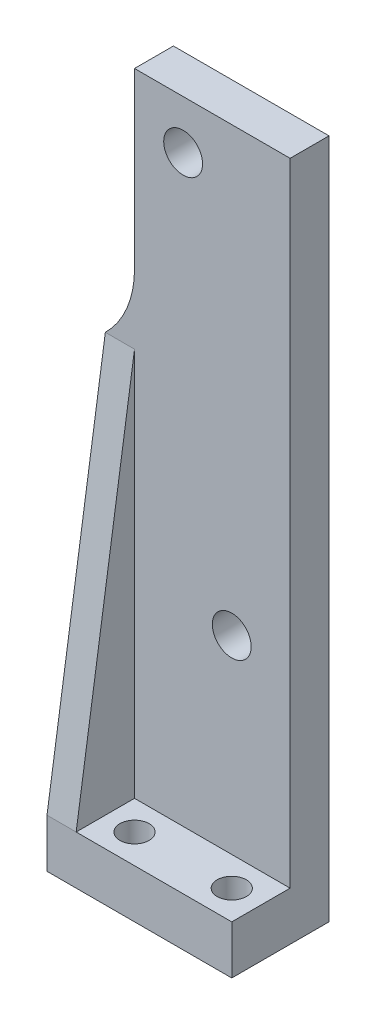
ISO-10303-21;
HEADER;
FILE_DESCRIPTION(('STEP AP214'),'2;1');
FILE_NAME('part.step','',(''),(''),'','','');
FILE_SCHEMA(('AUTOMOTIVE_DESIGN { 1 0 10303 214 1 1 1 1 }'));
ENDSEC;
DATA;
#1=APPLICATION_CONTEXT('core data for automotive mechanical design processes');
#2=APPLICATION_PROTOCOL_DEFINITION('international standard','automotive_design',2000,#1);
#3=PRODUCT_CONTEXT('',#1,'mechanical');
#4=PRODUCT('Part','Part','',(#3));
#5=PRODUCT_RELATED_PRODUCT_CATEGORY('part','',(#4));
#6=PRODUCT_DEFINITION_FORMATION('','',#4);
#7=PRODUCT_DEFINITION_CONTEXT('part definition',#1,'design');
#8=PRODUCT_DEFINITION('design','',#6,#7);
#9=PRODUCT_DEFINITION_SHAPE('','',#8);
#10=(LENGTH_UNIT() NAMED_UNIT(*) SI_UNIT(.MILLI.,.METRE.));
#11=(NAMED_UNIT(*) PLANE_ANGLE_UNIT() SI_UNIT($,.RADIAN.));
#12=(NAMED_UNIT(*) SI_UNIT($,.STERADIAN.) SOLID_ANGLE_UNIT());
#13=UNCERTAINTY_MEASURE_WITH_UNIT(LENGTH_MEASURE(1.E-05),#10,'distance_accuracy_value','');
#14=(GEOMETRIC_REPRESENTATION_CONTEXT(3) GLOBAL_UNCERTAINTY_ASSIGNED_CONTEXT((#13)) GLOBAL_UNIT_ASSIGNED_CONTEXT((#10,
#11,#12)) REPRESENTATION_CONTEXT('',''));
#15=CARTESIAN_POINT('',(0.,0.,0.));
#16=DIRECTION('',(0.,0.,1.));
#17=DIRECTION('',(1.,0.,0.));
#18=AXIS2_PLACEMENT_3D('',#15,#16,#17);
#19=CARTESIAN_POINT('',(-10.,5.,0.));
#20=DIRECTION('',(1.,0.,0.));
#21=DIRECTION('',(0.,0.,-1.));
#22=AXIS2_PLACEMENT_3D('',#19,#20,#21);
#23=PLANE('',#22);
#24=DIRECTION('',(0.,-1.,0.));
#25=VECTOR('',#24,1.);
#26=CARTESIAN_POINT('',(-9.99999999999999,70.,-7.));
#27=LINE('',#26,#25);
#28=CARTESIAN_POINT('',(-9.99999999999999,70.,-7.));
#29=VERTEX_POINT('',#28);
#30=CARTESIAN_POINT('',(-9.99999999999999,52.1414284285429,-7.));
#31=VERTEX_POINT('',#30);
#32=EDGE_CURVE('E162',#29,#31,#27,.T.);
#33=ORIENTED_EDGE('',*,*,#32,.T.);
#34=DIRECTION('',(0.,0.,-1.));
#35=VECTOR('',#34,1.);
#36=CARTESIAN_POINT('',(-10.,52.1414284285429,0.));
#37=LINE('',#36,#35);
#38=CARTESIAN_POINT('',(-9.99999999999999,52.1414284285429,-3.));
#39=VERTEX_POINT('',#38);
#40=EDGE_CURVE('E206',#31,#39,#37,.F.);
#41=ORIENTED_EDGE('',*,*,#40,.T.);
#42=DIRECTION('',(0.,-1.,0.));
#43=VECTOR('',#42,1.);
#44=CARTESIAN_POINT('',(-9.99999999999999,70.,-3.));
#45=LINE('',#44,#43);
#46=CARTESIAN_POINT('',(-9.99999999999999,70.,-3.));
#47=VERTEX_POINT('',#46);
#48=EDGE_CURVE('E156',#47,#39,#45,.T.);
#49=ORIENTED_EDGE('',*,*,#48,.F.);
#50=DIRECTION('',(0.,0.,1.));
#51=VECTOR('',#50,1.);
#52=CARTESIAN_POINT('',(-9.99999999999999,70.,-7.));
#53=LINE('',#52,#51);
#54=EDGE_CURVE('E174',#29,#47,#53,.T.);
#55=ORIENTED_EDGE('',*,*,#54,.F.);
#56=EDGE_LOOP('',(#33,#41,#49,#55));
#57=FACE_BOUND('',#56,.T.);
#58=ADVANCED_FACE('F41',(#57),#23,.F.);
#59=CARTESIAN_POINT('',(-5.,65.,3.));
#60=DIRECTION('',(0.,0.,-1.));
#61=DIRECTION('',(-1.,0.,0.));
#62=AXIS2_PLACEMENT_3D('',#59,#60,#61);
#63=CYLINDRICAL_SURFACE('',#62,2.);
#64=CARTESIAN_POINT('',(-5.,65.,-3.));
#65=DIRECTION('',(0.,0.,1.));
#66=DIRECTION('',(1.,0.,0.));
#67=AXIS2_PLACEMENT_3D('',#64,#65,#66);
#68=CIRCLE('',#67,2.);
#69=CARTESIAN_POINT('',(-3.,65.,-3.));
#70=VERTEX_POINT('',#69);
#71=EDGE_CURVE('E168',#70,#70,#68,.T.);
#72=ORIENTED_EDGE('',*,*,#71,.T.);
#73=EDGE_LOOP('',(#72));
#74=FACE_BOUND('',#73,.T.);
#75=CARTESIAN_POINT('',(-5.,65.,-6.));
#76=DIRECTION('',(0.,0.,-1.));
#77=DIRECTION('',(-1.,0.,0.));
#78=AXIS2_PLACEMENT_3D('',#75,#76,#77);
#79=CIRCLE('',#78,2.);
#80=CARTESIAN_POINT('',(-7.,65.,-6.));
#81=VERTEX_POINT('',#80);
#82=EDGE_CURVE('E146',#81,#81,#79,.F.);
#83=ORIENTED_EDGE('',*,*,#82,.F.);
#84=EDGE_LOOP('',(#83));
#85=FACE_BOUND('',#84,.T.);
#86=ADVANCED_FACE('F243',(#74,#85),#63,.F.);
#87=CARTESIAN_POINT('',(0.,5.,3.));
#88=DIRECTION('',(0.,0.,-1.));
#89=DIRECTION('',(-1.,0.,0.));
#90=AXIS2_PLACEMENT_3D('',#87,#88,#89);
#91=PLANE('',#90);
#92=DIRECTION('',(1.,0.,0.));
#93=VECTOR('',#92,1.);
#94=CARTESIAN_POINT('',(0.,0.,3.));
#95=LINE('',#94,#93);
#96=CARTESIAN_POINT('',(-13.,0.,3.));
#97=VERTEX_POINT('',#96);
#98=CARTESIAN_POINT('',(6.,0.,3.));
#99=VERTEX_POINT('',#98);
#100=EDGE_CURVE('E201',#97,#99,#95,.T.);
#101=ORIENTED_EDGE('',*,*,#100,.T.);
#102=DIRECTION('',(0.,-1.,0.));
#103=VECTOR('',#102,1.);
#104=CARTESIAN_POINT('',(6.,5.,3.));
#105=LINE('',#104,#103);
#106=CARTESIAN_POINT('',(6.,5.,3.));
#107=VERTEX_POINT('',#106);
#108=EDGE_CURVE('E195',#107,#99,#105,.T.);
#109=ORIENTED_EDGE('',*,*,#108,.F.);
#110=DIRECTION('',(1.,0.,0.));
#111=VECTOR('',#110,1.);
#112=CARTESIAN_POINT('',(0.,5.,3.));
#113=LINE('',#112,#111);
#114=CARTESIAN_POINT('',(-10.,5.,3.));
#115=VERTEX_POINT('',#114);
#116=EDGE_CURVE('E134',#115,#107,#113,.T.);
#117=ORIENTED_EDGE('',*,*,#116,.F.);
#118=DIRECTION('',(1.,0.,0.));
#119=VECTOR('',#118,1.);
#120=CARTESIAN_POINT('',(-13.,5.,3.));
#121=LINE('',#120,#119);
#122=CARTESIAN_POINT('',(-13.,5.,3.));
#123=VERTEX_POINT('',#122);
#124=EDGE_CURVE('E116',#123,#115,#121,.T.);
#125=ORIENTED_EDGE('',*,*,#124,.F.);
#126=DIRECTION('',(0.,1.,0.));
#127=VECTOR('',#126,1.);
#128=CARTESIAN_POINT('',(-13.,0.,3.));
#129=LINE('',#128,#127);
#130=EDGE_CURVE('E119',#97,#123,#129,.T.);
#131=ORIENTED_EDGE('',*,*,#130,.F.);
#132=EDGE_LOOP('',(#101,#109,#117,#125,#131));
#133=FACE_BOUND('',#132,.T.);
#134=ADVANCED_FACE('F132',(#133),#91,.F.);
#135=CARTESIAN_POINT('',(6.,5.,0.));
#136=DIRECTION('',(1.,0.,0.));
#137=DIRECTION('',(0.,0.,-1.));
#138=AXIS2_PLACEMENT_3D('',#135,#136,#137);
#139=PLANE('',#138);
#140=DIRECTION('',(0.,0.,1.));
#141=VECTOR('',#140,1.);
#142=CARTESIAN_POINT('',(6.,0.,0.));
#143=LINE('',#142,#141);
#144=CARTESIAN_POINT('',(6.,0.,-7.));
#145=VERTEX_POINT('',#144);
#146=EDGE_CURVE('E183',#145,#99,#143,.T.);
#147=ORIENTED_EDGE('',*,*,#146,.F.);
#148=DIRECTION('',(0.,1.,0.));
#149=VECTOR('',#148,1.);
#150=CARTESIAN_POINT('',(6.,0.,-7.));
#151=LINE('',#150,#149);
#152=CARTESIAN_POINT('',(6.,70.,-7.));
#153=VERTEX_POINT('',#152);
#154=EDGE_CURVE('E155',#145,#153,#151,.T.);
#155=ORIENTED_EDGE('',*,*,#154,.T.);
#156=DIRECTION('',(0.,0.,1.));
#157=VECTOR('',#156,1.);
#158=CARTESIAN_POINT('',(6.,70.,-7.));
#159=LINE('',#158,#157);
#160=CARTESIAN_POINT('',(6.,70.,-3.));
#161=VERTEX_POINT('',#160);
#162=EDGE_CURVE('E164',#153,#161,#159,.T.);
#163=ORIENTED_EDGE('',*,*,#162,.T.);
#164=DIRECTION('',(0.,1.,0.));
#165=VECTOR('',#164,1.);
#166=CARTESIAN_POINT('',(6.,0.,-3.));
#167=LINE('',#166,#165);
#168=CARTESIAN_POINT('',(6.,5.,-3.));
#169=VERTEX_POINT('',#168);
#170=EDGE_CURVE('E165',#169,#161,#167,.T.);
#171=ORIENTED_EDGE('',*,*,#170,.F.);
#172=DIRECTION('',(0.,0.,1.));
#173=VECTOR('',#172,1.);
#174=CARTESIAN_POINT('',(6.,5.,0.));
#175=LINE('',#174,#173);
#176=EDGE_CURVE('E187',#169,#107,#175,.T.);
#177=ORIENTED_EDGE('',*,*,#176,.T.);
#178=ORIENTED_EDGE('',*,*,#108,.T.);
#179=EDGE_LOOP('',(#147,#155,#163,#171,#177,#178));
#180=FACE_BOUND('',#179,.T.);
#181=ADVANCED_FACE('F227',(#180),#139,.T.);
#182=CARTESIAN_POINT('',(-7.,5.,0.));
#183=DIRECTION('',(0.,-1.,0.));
#184=DIRECTION('',(0.,0.,-1.));
#185=AXIS2_PLACEMENT_3D('',#182,#183,#184);
#186=CYLINDRICAL_SURFACE('',#185,1.5);
#187=CARTESIAN_POINT('',(-7.,5.,0.));
#188=DIRECTION('',(0.,1.,0.));
#189=DIRECTION('',(0.,0.,1.));
#190=AXIS2_PLACEMENT_3D('',#187,#188,#189);
#191=CIRCLE('',#190,1.5);
#192=CARTESIAN_POINT('',(-7.,5.,1.5));
#193=VERTEX_POINT('',#192);
#194=EDGE_CURVE('E182',#193,#193,#191,.T.);
#195=ORIENTED_EDGE('',*,*,#194,.T.);
#196=EDGE_LOOP('',(#195));
#197=FACE_BOUND('',#196,.T.);
#198=CARTESIAN_POINT('',(-7.,0.,0.));
#199=DIRECTION('',(0.,1.,0.));
#200=DIRECTION('',(0.,0.,1.));
#201=AXIS2_PLACEMENT_3D('',#198,#199,#200);
#202=CIRCLE('',#201,1.5);
#203=CARTESIAN_POINT('',(-7.,0.,1.5));
#204=VERTEX_POINT('',#203);
#205=EDGE_CURVE('E198',#204,#204,#202,.T.);
#206=ORIENTED_EDGE('',*,*,#205,.F.);
#207=EDGE_LOOP('',(#206));
#208=FACE_BOUND('',#207,.T.);
#209=ADVANCED_FACE('F256',(#197,#208),#186,.F.);
#210=CARTESIAN_POINT('',(3.,5.,0.));
#211=DIRECTION('',(0.,-1.,0.));
#212=DIRECTION('',(0.,0.,-1.));
#213=AXIS2_PLACEMENT_3D('',#210,#211,#212);
#214=CYLINDRICAL_SURFACE('',#213,1.5);
#215=CARTESIAN_POINT('',(3.,5.,0.));
#216=DIRECTION('',(0.,1.,0.));
#217=DIRECTION('',(0.,0.,1.));
#218=AXIS2_PLACEMENT_3D('',#215,#216,#217);
#219=CIRCLE('',#218,1.5);
#220=CARTESIAN_POINT('',(3.,5.,1.5));
#221=VERTEX_POINT('',#220);
#222=EDGE_CURVE('E179',#221,#221,#219,.T.);
#223=ORIENTED_EDGE('',*,*,#222,.T.);
#224=EDGE_LOOP('',(#223));
#225=FACE_BOUND('',#224,.T.);
#226=CARTESIAN_POINT('',(3.,0.,0.));
#227=DIRECTION('',(0.,1.,0.));
#228=DIRECTION('',(0.,0.,1.));
#229=AXIS2_PLACEMENT_3D('',#226,#227,#228);
#230=CIRCLE('',#229,1.5);
#231=CARTESIAN_POINT('',(3.,0.,1.5));
#232=VERTEX_POINT('',#231);
#233=EDGE_CURVE('E176',#232,#232,#230,.T.);
#234=ORIENTED_EDGE('',*,*,#233,.F.);
#235=EDGE_LOOP('',(#234));
#236=FACE_BOUND('',#235,.T.);
#237=ADVANCED_FACE('F260',(#225,#236),#214,.F.);
#238=CARTESIAN_POINT('',(0.,5.,0.));
#239=DIRECTION('',(0.,1.,0.));
#240=DIRECTION('',(0.,0.,1.));
#241=AXIS2_PLACEMENT_3D('',#238,#239,#240);
#242=PLANE('',#241);
#243=ORIENTED_EDGE('',*,*,#222,.F.);
#244=EDGE_LOOP('',(#243));
#245=FACE_BOUND('',#244,.T.);
#246=ORIENTED_EDGE('',*,*,#194,.F.);
#247=EDGE_LOOP('',(#246));
#248=FACE_BOUND('',#247,.T.);
#249=ORIENTED_EDGE('',*,*,#116,.T.);
#250=ORIENTED_EDGE('',*,*,#176,.F.);
#251=DIRECTION('',(1.,0.,0.));
#252=VECTOR('',#251,1.);
#253=CARTESIAN_POINT('',(0.,5.,-3.));
#254=LINE('',#253,#252);
#255=CARTESIAN_POINT('',(-10.,5.,-3.));
#256=VERTEX_POINT('',#255);
#257=EDGE_CURVE('E190',#256,#169,#254,.T.);
#258=ORIENTED_EDGE('',*,*,#257,.F.);
#259=DIRECTION('',(0.,0.,1.));
#260=VECTOR('',#259,1.);
#261=CARTESIAN_POINT('',(-10.,5.,0.));
#262=LINE('',#261,#260);
#263=EDGE_CURVE('E193',#256,#115,#262,.T.);
#264=ORIENTED_EDGE('',*,*,#263,.T.);
#265=EDGE_LOOP('',(#249,#250,#258,#264));
#266=FACE_BOUND('',#265,.T.);
#267=ADVANCED_FACE('F230',(#245,#248,#266),#242,.T.);
#268=CARTESIAN_POINT('',(0.,0.,0.));
#269=DIRECTION('',(0.,1.,0.));
#270=DIRECTION('',(0.,0.,1.));
#271=AXIS2_PLACEMENT_3D('',#268,#269,#270);
#272=PLANE('',#271);
#273=ORIENTED_EDGE('',*,*,#233,.T.);
#274=EDGE_LOOP('',(#273));
#275=FACE_BOUND('',#274,.T.);
#276=ORIENTED_EDGE('',*,*,#205,.T.);
#277=EDGE_LOOP('',(#276));
#278=FACE_BOUND('',#277,.T.);
#279=ORIENTED_EDGE('',*,*,#100,.F.);
#280=DIRECTION('',(0.,0.,1.));
#281=VECTOR('',#280,1.);
#282=CARTESIAN_POINT('',(-13.,0.,0.));
#283=LINE('',#282,#281);
#284=CARTESIAN_POINT('',(-13.,0.,-7.));
#285=VERTEX_POINT('',#284);
#286=EDGE_CURVE('E126',#285,#97,#283,.T.);
#287=ORIENTED_EDGE('',*,*,#286,.F.);
#288=DIRECTION('',(1.,0.,0.));
#289=VECTOR('',#288,1.);
#290=CARTESIAN_POINT('',(-10.,0.,-7.));
#291=LINE('',#290,#289);
#292=EDGE_CURVE('E152',#285,#145,#291,.T.);
#293=ORIENTED_EDGE('',*,*,#292,.T.);
#294=ORIENTED_EDGE('',*,*,#146,.T.);
#295=EDGE_LOOP('',(#279,#287,#293,#294));
#296=FACE_BOUND('',#295,.T.);
#297=ADVANCED_FACE('F224',(#275,#278,#296),#272,.F.);
#298=CARTESIAN_POINT('',(6.,70.,-7.));
#299=DIRECTION('',(0.,1.,0.));
#300=DIRECTION('',(0.,0.,1.));
#301=AXIS2_PLACEMENT_3D('',#298,#299,#300);
#302=PLANE('',#301);
#303=DIRECTION('',(-1.,0.,0.));
#304=VECTOR('',#303,1.);
#305=CARTESIAN_POINT('',(6.,70.,-3.));
#306=LINE('',#305,#304);
#307=EDGE_CURVE('E167',#161,#47,#306,.T.);
#308=ORIENTED_EDGE('',*,*,#307,.F.);
#309=ORIENTED_EDGE('',*,*,#162,.F.);
#310=DIRECTION('',(-1.,0.,0.));
#311=VECTOR('',#310,1.);
#312=CARTESIAN_POINT('',(6.,70.,-7.));
#313=LINE('',#312,#311);
#314=EDGE_CURVE('E159',#153,#29,#313,.T.);
#315=ORIENTED_EDGE('',*,*,#314,.T.);
#316=ORIENTED_EDGE('',*,*,#54,.T.);
#317=EDGE_LOOP('',(#308,#309,#315,#316));
#318=FACE_BOUND('',#317,.T.);
#319=ADVANCED_FACE('F274',(#318),#302,.T.);
#320=CARTESIAN_POINT('',(0.,0.,-7.));
#321=DIRECTION('',(0.,0.,1.));
#322=DIRECTION('',(1.,0.,0.));
#323=AXIS2_PLACEMENT_3D('',#320,#321,#322);
#324=PLANE('',#323);
#325=CARTESIAN_POINT('',(-5.,65.,-7.));
#326=DIRECTION('',(0.,0.,-1.));
#327=DIRECTION('',(-1.,0.,0.));
#328=AXIS2_PLACEMENT_3D('',#325,#326,#327);
#329=CIRCLE('',#328,3.5);
#330=CARTESIAN_POINT('',(-8.5,65.,-7.));
#331=VERTEX_POINT('',#330);
#332=EDGE_CURVE('E136',#331,#331,#329,.T.);
#333=ORIENTED_EDGE('',*,*,#332,.F.);
#334=EDGE_LOOP('',(#333));
#335=FACE_BOUND('',#334,.T.);
#336=CARTESIAN_POINT('',(0.,24.5,-7.));
#337=DIRECTION('',(0.,0.,-1.));
#338=DIRECTION('',(-1.,0.,0.));
#339=AXIS2_PLACEMENT_3D('',#336,#337,#338);
#340=CIRCLE('',#339,2.);
#341=CARTESIAN_POINT('',(-2.,24.5,-7.));
#342=VERTEX_POINT('',#341);
#343=EDGE_CURVE('E148',#342,#342,#340,.T.);
#344=ORIENTED_EDGE('',*,*,#343,.F.);
#345=EDGE_LOOP('',(#344));
#346=FACE_BOUND('',#345,.T.);
#347=ORIENTED_EDGE('',*,*,#292,.F.);
#348=DIRECTION('',(0.,-1.,0.));
#349=VECTOR('',#348,1.);
#350=CARTESIAN_POINT('',(-13.,0.,-7.));
#351=LINE('',#350,#349);
#352=CARTESIAN_POINT('',(-13.,45.,-7.));
#353=VERTEX_POINT('',#352);
#354=EDGE_CURVE('E141',#353,#285,#351,.T.);
#355=ORIENTED_EDGE('',*,*,#354,.F.);
#356=CARTESIAN_POINT('',(-20.,52.1414284285429,-7.));
#357=DIRECTION('',(0.,0.,1.));
#358=DIRECTION('',(1.,0.,0.));
#359=AXIS2_PLACEMENT_3D('',#356,#357,#358);
#360=CIRCLE('',#359,10.);
#361=EDGE_CURVE('E64',#353,#31,#360,.T.);
#362=ORIENTED_EDGE('',*,*,#361,.T.);
#363=ORIENTED_EDGE('',*,*,#32,.F.);
#364=ORIENTED_EDGE('',*,*,#314,.F.);
#365=ORIENTED_EDGE('',*,*,#154,.F.);
#366=EDGE_LOOP('',(#347,#355,#362,#363,#364,#365));
#367=FACE_BOUND('',#366,.T.);
#368=ADVANCED_FACE('F280',(#335,#346,#367),#324,.F.);
#369=CARTESIAN_POINT('',(0.,0.,-3.));
#370=DIRECTION('',(0.,0.,1.));
#371=DIRECTION('',(1.,0.,0.));
#372=AXIS2_PLACEMENT_3D('',#369,#370,#371);
#373=PLANE('',#372);
#374=CARTESIAN_POINT('',(0.,24.5,-3.));
#375=DIRECTION('',(0.,0.,1.));
#376=DIRECTION('',(1.,0.,0.));
#377=AXIS2_PLACEMENT_3D('',#374,#375,#376);
#378=CIRCLE('',#377,2.);
#379=CARTESIAN_POINT('',(2.,24.5,-3.));
#380=VERTEX_POINT('',#379);
#381=EDGE_CURVE('E151',#380,#380,#378,.T.);
#382=ORIENTED_EDGE('',*,*,#381,.F.);
#383=EDGE_LOOP('',(#382));
#384=FACE_BOUND('',#383,.T.);
#385=ORIENTED_EDGE('',*,*,#71,.F.);
#386=EDGE_LOOP('',(#385));
#387=FACE_BOUND('',#386,.T.);
#388=ORIENTED_EDGE('',*,*,#48,.T.);
#389=CARTESIAN_POINT('',(-20.,52.1414284285429,-3.));
#390=DIRECTION('',(0.,0.,1.));
#391=DIRECTION('',(1.,0.,0.));
#392=AXIS2_PLACEMENT_3D('',#389,#390,#391);
#393=CIRCLE('',#392,10.);
#394=CARTESIAN_POINT('',(-13.,45.,-3.));
#395=VERTEX_POINT('',#394);
#396=EDGE_CURVE('E49',#39,#395,#393,.F.);
#397=ORIENTED_EDGE('',*,*,#396,.T.);
#398=DIRECTION('',(-1.,0.,0.));
#399=VECTOR('',#398,1.);
#400=CARTESIAN_POINT('',(-12.9999999999999,45.,-3.));
#401=LINE('',#400,#399);
#402=CARTESIAN_POINT('',(-9.99999999999999,45.000000000001,-3.00000000000008));
#403=VERTEX_POINT('',#402);
#404=EDGE_CURVE('E11',#403,#395,#401,.T.);
#405=ORIENTED_EDGE('',*,*,#404,.F.);
#406=EDGE_CURVE('E171',#403,#256,#45,.T.);
#407=ORIENTED_EDGE('',*,*,#406,.T.);
#408=ORIENTED_EDGE('',*,*,#257,.T.);
#409=ORIENTED_EDGE('',*,*,#170,.T.);
#410=ORIENTED_EDGE('',*,*,#307,.T.);
#411=EDGE_LOOP('',(#388,#397,#405,#407,#408,#409,#410));
#412=FACE_BOUND('',#411,.T.);
#413=ADVANCED_FACE('F216',(#384,#387,#412),#373,.T.);
#414=CARTESIAN_POINT('',(0.,24.5,3.));
#415=DIRECTION('',(0.,0.,-1.));
#416=DIRECTION('',(-1.,0.,0.));
#417=AXIS2_PLACEMENT_3D('',#414,#415,#416);
#418=CYLINDRICAL_SURFACE('',#417,2.);
#419=ORIENTED_EDGE('',*,*,#381,.T.);
#420=EDGE_LOOP('',(#419));
#421=FACE_BOUND('',#420,.T.);
#422=ORIENTED_EDGE('',*,*,#343,.T.);
#423=EDGE_LOOP('',(#422));
#424=FACE_BOUND('',#423,.T.);
#425=ADVANCED_FACE('F291',(#421,#424),#418,.F.);
#426=CARTESIAN_POINT('',(-5.,65.,-6.));
#427=DIRECTION('',(0.,0.,-1.));
#428=DIRECTION('',(-1.,0.,0.));
#429=AXIS2_PLACEMENT_3D('',#426,#427,#428);
#430=PLANE('',#429);
#431=CARTESIAN_POINT('',(-5.,65.,-6.));
#432=DIRECTION('',(0.,0.,-1.));
#433=DIRECTION('',(-1.,0.,0.));
#434=AXIS2_PLACEMENT_3D('',#431,#432,#433);
#435=CIRCLE('',#434,3.5);
#436=CARTESIAN_POINT('',(-8.5,65.,-6.));
#437=VERTEX_POINT('',#436);
#438=EDGE_CURVE('E139',#437,#437,#435,.T.);
#439=ORIENTED_EDGE('',*,*,#438,.T.);
#440=EDGE_LOOP('',(#439));
#441=FACE_BOUND('',#440,.T.);
#442=ORIENTED_EDGE('',*,*,#82,.T.);
#443=EDGE_LOOP('',(#442));
#444=FACE_BOUND('',#443,.T.);
#445=ADVANCED_FACE('F296',(#441,#444),#430,.T.);
#446=CARTESIAN_POINT('',(-5.,65.,-6.));
#447=DIRECTION('',(0.,0.,-1.));
#448=DIRECTION('',(-1.,0.,0.));
#449=AXIS2_PLACEMENT_3D('',#446,#447,#448);
#450=CYLINDRICAL_SURFACE('',#449,3.5);
#451=ORIENTED_EDGE('',*,*,#438,.F.);
#452=EDGE_LOOP('',(#451));
#453=FACE_BOUND('',#452,.T.);
#454=ORIENTED_EDGE('',*,*,#332,.T.);
#455=EDGE_LOOP('',(#454));
#456=FACE_BOUND('',#455,.T.);
#457=ADVANCED_FACE('F298',(#453,#456),#450,.F.);
#458=CARTESIAN_POINT('',(-13.,0.550122249388753,3.66748166259169));
#459=DIRECTION('',(0.,-0.148340452930245,-0.988936352868297));
#460=DIRECTION('',(0.,0.988936352868298,-0.148340452930245));
#461=AXIS2_PLACEMENT_3D('',#458,#459,#460);
#462=PLANE('',#461);
#463=DIRECTION('',(0.,0.988936352868298,-0.148340452930245));
#464=VECTOR('',#463,1.);
#465=CARTESIAN_POINT('',(-10.,0.550122249388753,3.66748166259169));
#466=LINE('',#465,#464);
#467=EDGE_CURVE('E129',#115,#403,#466,.T.);
#468=ORIENTED_EDGE('',*,*,#467,.T.);
#469=ORIENTED_EDGE('',*,*,#404,.T.);
#470=DIRECTION('',(0.,0.988936352868298,-0.148340452930245));
#471=VECTOR('',#470,1.);
#472=CARTESIAN_POINT('',(-13.,0.550122249388753,3.66748166259169));
#473=LINE('',#472,#471);
#474=EDGE_CURVE('E56',#123,#395,#473,.T.);
#475=ORIENTED_EDGE('',*,*,#474,.F.);
#476=ORIENTED_EDGE('',*,*,#124,.T.);
#477=EDGE_LOOP('',(#468,#469,#475,#476));
#478=FACE_BOUND('',#477,.T.);
#479=ADVANCED_FACE('F114',(#478),#462,.F.);
#480=CARTESIAN_POINT('',(-13.,0.,0.));
#481=DIRECTION('',(-1.,0.,0.));
#482=DIRECTION('',(0.,0.,1.));
#483=AXIS2_PLACEMENT_3D('',#480,#481,#482);
#484=PLANE('',#483);
#485=ORIENTED_EDGE('',*,*,#130,.T.);
#486=ORIENTED_EDGE('',*,*,#474,.T.);
#487=DIRECTION('',(0.,0.,-1.));
#488=VECTOR('',#487,1.);
#489=CARTESIAN_POINT('',(-13.,45.,0.));
#490=LINE('',#489,#488);
#491=EDGE_CURVE('E118',#395,#353,#490,.T.);
#492=ORIENTED_EDGE('',*,*,#491,.T.);
#493=ORIENTED_EDGE('',*,*,#354,.T.);
#494=ORIENTED_EDGE('',*,*,#286,.T.);
#495=EDGE_LOOP('',(#485,#486,#492,#493,#494));
#496=FACE_BOUND('',#495,.T.);
#497=ADVANCED_FACE('F123',(#496),#484,.T.);
#498=CARTESIAN_POINT('',(-10.,0.,0.));
#499=DIRECTION('',(-1.,0.,0.));
#500=DIRECTION('',(0.,0.,1.));
#501=AXIS2_PLACEMENT_3D('',#498,#499,#500);
#502=PLANE('',#501);
#503=ORIENTED_EDGE('',*,*,#263,.F.);
#504=ORIENTED_EDGE('',*,*,#406,.F.);
#505=ORIENTED_EDGE('',*,*,#467,.F.);
#506=EDGE_LOOP('',(#503,#504,#505));
#507=FACE_BOUND('',#506,.T.);
#508=ADVANCED_FACE('F233',(#507),#502,.F.);
#509=CARTESIAN_POINT('',(-20.,52.1414284285429,0.));
#510=DIRECTION('',(0.,0.,-1.));
#511=DIRECTION('',(-1.,0.,0.));
#512=AXIS2_PLACEMENT_3D('',#509,#510,#511);
#513=CYLINDRICAL_SURFACE('',#512,10.);
#514=ORIENTED_EDGE('',*,*,#396,.F.);
#515=ORIENTED_EDGE('',*,*,#40,.F.);
#516=ORIENTED_EDGE('',*,*,#361,.F.);
#517=ORIENTED_EDGE('',*,*,#491,.F.);
#518=EDGE_LOOP('',(#514,#515,#516,#517));
#519=FACE_BOUND('',#518,.T.);
#520=ADVANCED_FACE('F43',(#519),#513,.F.);
#521=CLOSED_SHELL('',(#58,#86,#134,#181,#209,#237,#267,#297,#319,#368,#413,#425,#445,#457,#479,
#497,#508,#520));
#522=MANIFOLD_SOLID_BREP('B2',#521);
#523=ADVANCED_BREP_SHAPE_REPRESENTATION('',(#18,#522),#14);
#524=SHAPE_DEFINITION_REPRESENTATION(#9,#523);
ENDSEC;
END-ISO-10303-21;
